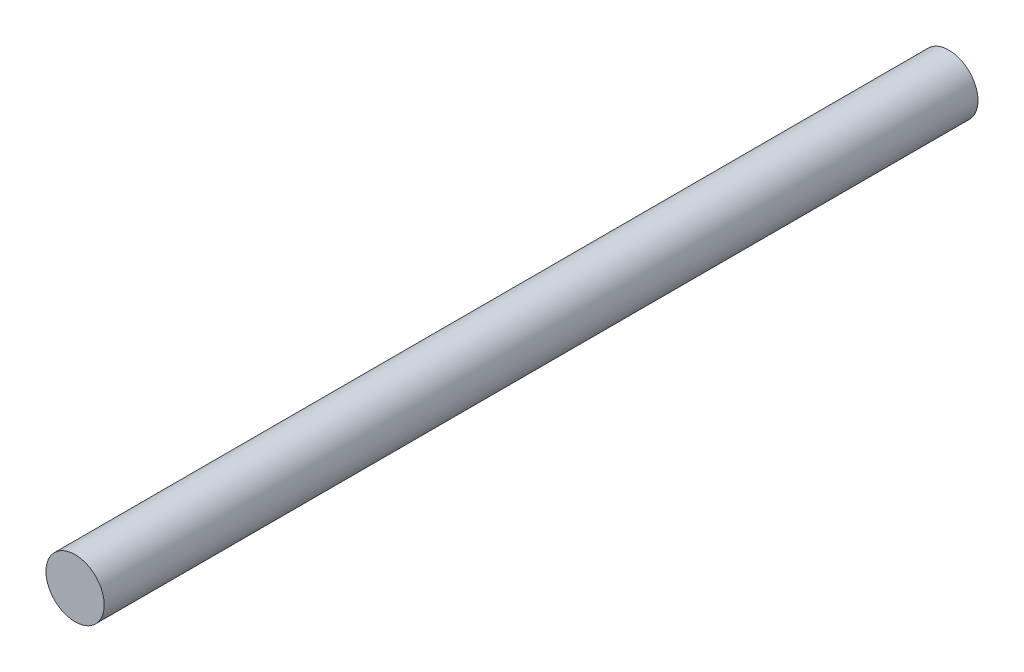
ISO-10303-21;
HEADER;
FILE_DESCRIPTION(('STEP AP214'),'2;1');
FILE_NAME('part.step','',(''),(''),'','','');
FILE_SCHEMA(('AUTOMOTIVE_DESIGN { 1 0 10303 214 1 1 1 1 }'));
ENDSEC;
DATA;
#1=APPLICATION_CONTEXT('core data for automotive mechanical design processes');
#2=APPLICATION_PROTOCOL_DEFINITION('international standard','automotive_design',2000,#1);
#3=PRODUCT_CONTEXT('',#1,'mechanical');
#4=PRODUCT('Part','Part','',(#3));
#5=PRODUCT_RELATED_PRODUCT_CATEGORY('part','',(#4));
#6=PRODUCT_DEFINITION_FORMATION('','',#4);
#7=PRODUCT_DEFINITION_CONTEXT('part definition',#1,'design');
#8=PRODUCT_DEFINITION('design','',#6,#7);
#9=PRODUCT_DEFINITION_SHAPE('','',#8);
#10=(LENGTH_UNIT() NAMED_UNIT(*) SI_UNIT(.MILLI.,.METRE.));
#11=(NAMED_UNIT(*) PLANE_ANGLE_UNIT() SI_UNIT($,.RADIAN.));
#12=(NAMED_UNIT(*) SI_UNIT($,.STERADIAN.) SOLID_ANGLE_UNIT());
#13=UNCERTAINTY_MEASURE_WITH_UNIT(LENGTH_MEASURE(1.E-05),#10,'distance_accuracy_value','');
#14=(GEOMETRIC_REPRESENTATION_CONTEXT(3) GLOBAL_UNCERTAINTY_ASSIGNED_CONTEXT((#13)) GLOBAL_UNIT_ASSIGNED_CONTEXT((#10,
#11,#12)) REPRESENTATION_CONTEXT('',''));
#15=CARTESIAN_POINT('',(0.,0.,0.));
#16=DIRECTION('',(0.,0.,1.));
#17=DIRECTION('',(1.,0.,0.));
#18=AXIS2_PLACEMENT_3D('',#15,#16,#17);
#19=CARTESIAN_POINT('',(0.,10.6109443065967,30.));
#20=DIRECTION('',(0.,0.,-1.));
#21=DIRECTION('',(-1.,0.,0.));
#22=AXIS2_PLACEMENT_3D('',#19,#20,#21);
#23=CYLINDRICAL_SURFACE('',#22,1.);
#24=CARTESIAN_POINT('',(0.,10.6109443065967,30.));
#25=DIRECTION('',(0.,0.,1.));
#26=DIRECTION('',(1.,0.,0.));
#27=AXIS2_PLACEMENT_3D('',#24,#25,#26);
#28=CIRCLE('',#27,1.);
#29=CARTESIAN_POINT('',(1.,10.6109443065967,30.));
#30=VERTEX_POINT('',#29);
#31=EDGE_CURVE('E10',#30,#30,#28,.T.);
#32=ORIENTED_EDGE('',*,*,#31,.F.);
#33=EDGE_LOOP('',(#32));
#34=FACE_BOUND('',#33,.T.);
#35=CARTESIAN_POINT('',(0.,10.6109443065967,0.));
#36=DIRECTION('',(0.,0.,1.));
#37=DIRECTION('',(1.,0.,0.));
#38=AXIS2_PLACEMENT_3D('',#35,#36,#37);
#39=CIRCLE('',#38,1.);
#40=CARTESIAN_POINT('',(1.,10.6109443065967,0.));
#41=VERTEX_POINT('',#40);
#42=EDGE_CURVE('E38',#41,#41,#39,.T.);
#43=ORIENTED_EDGE('',*,*,#42,.T.);
#44=EDGE_LOOP('',(#43));
#45=FACE_BOUND('',#44,.T.);
#46=ADVANCED_FACE('F35',(#34,#45),#23,.T.);
#47=CARTESIAN_POINT('',(0.,10.6109443065967,30.));
#48=DIRECTION('',(0.,0.,1.));
#49=DIRECTION('',(1.,0.,0.));
#50=AXIS2_PLACEMENT_3D('',#47,#48,#49);
#51=PLANE('',#50);
#52=ORIENTED_EDGE('',*,*,#31,.T.);
#53=EDGE_LOOP('',(#52));
#54=FACE_BOUND('',#53,.T.);
#55=ADVANCED_FACE('F50',(#54),#51,.T.);
#56=CARTESIAN_POINT('',(0.,10.6109443065967,0.));
#57=DIRECTION('',(0.,0.,1.));
#58=DIRECTION('',(1.,0.,0.));
#59=AXIS2_PLACEMENT_3D('',#56,#57,#58);
#60=PLANE('',#59);
#61=ORIENTED_EDGE('',*,*,#42,.F.);
#62=EDGE_LOOP('',(#61));
#63=FACE_BOUND('',#62,.T.);
#64=ADVANCED_FACE('F48',(#63),#60,.F.);
#65=CLOSED_SHELL('',(#46,#55,#64));
#66=MANIFOLD_SOLID_BREP('B2',#65);
#67=ADVANCED_BREP_SHAPE_REPRESENTATION('',(#18,#66),#14);
#68=SHAPE_DEFINITION_REPRESENTATION(#9,#67);
ENDSEC;
END-ISO-10303-21;
